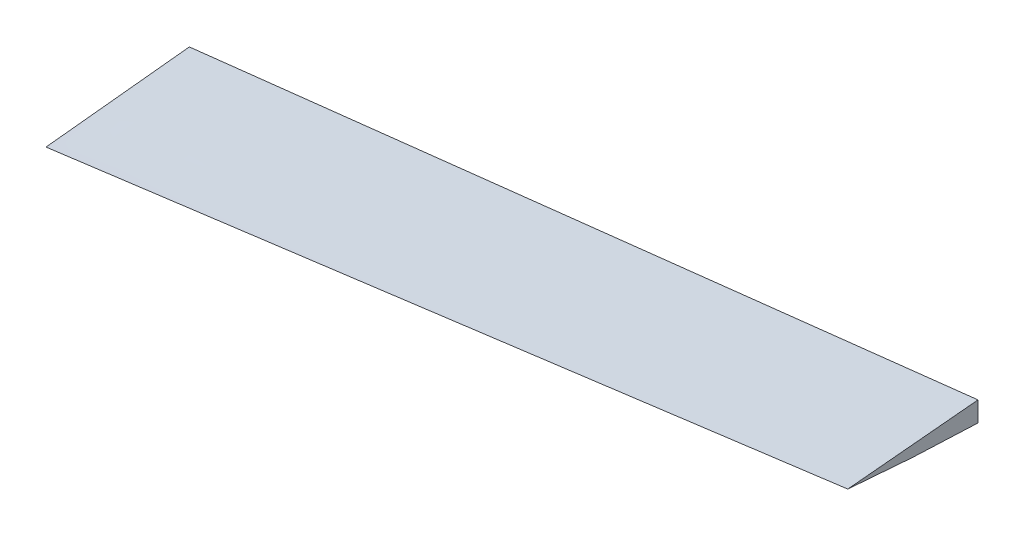
ISO-10303-21;
HEADER;
FILE_DESCRIPTION(('STEP AP214'),'2;1');
FILE_NAME('part.step','',(''),(''),'','','');
FILE_SCHEMA(('AUTOMOTIVE_DESIGN { 1 0 10303 214 1 1 1 1 }'));
ENDSEC;
DATA;
#1=APPLICATION_CONTEXT('core data for automotive mechanical design processes');
#2=APPLICATION_PROTOCOL_DEFINITION('international standard','automotive_design',2000,#1);
#3=PRODUCT_CONTEXT('',#1,'mechanical');
#4=PRODUCT('Part','Part','',(#3));
#5=PRODUCT_RELATED_PRODUCT_CATEGORY('part','',(#4));
#6=PRODUCT_DEFINITION_FORMATION('','',#4);
#7=PRODUCT_DEFINITION_CONTEXT('part definition',#1,'design');
#8=PRODUCT_DEFINITION('design','',#6,#7);
#9=PRODUCT_DEFINITION_SHAPE('','',#8);
#10=(LENGTH_UNIT() NAMED_UNIT(*) SI_UNIT(.MILLI.,.METRE.));
#11=(NAMED_UNIT(*) PLANE_ANGLE_UNIT() SI_UNIT($,.RADIAN.));
#12=(NAMED_UNIT(*) SI_UNIT($,.STERADIAN.) SOLID_ANGLE_UNIT());
#13=UNCERTAINTY_MEASURE_WITH_UNIT(LENGTH_MEASURE(1.E-05),#10,'distance_accuracy_value','');
#14=(GEOMETRIC_REPRESENTATION_CONTEXT(3) GLOBAL_UNCERTAINTY_ASSIGNED_CONTEXT((#13)) GLOBAL_UNIT_ASSIGNED_CONTEXT((#10,
#11,#12)) REPRESENTATION_CONTEXT('',''));
#15=CARTESIAN_POINT('',(0.,0.,0.));
#16=DIRECTION('',(0.,0.,1.));
#17=DIRECTION('',(1.,0.,0.));
#18=AXIS2_PLACEMENT_3D('',#15,#16,#17);
#19=CARTESIAN_POINT('',(940.,-9.56504290397643,223.608063618976));
#20=CARTESIAN_POINT('',(3360.,233.06816214663,316.471394972551));
#21=CARTESIAN_POINT('',(940.,-8.02027267485098,223.497813242443));
#22=CARTESIAN_POINT('',(3360.,233.496407991043,316.470996572016));
#23=CARTESIAN_POINT('',(940.,-4.47959626742021,223.565804357872));
#24=CARTESIAN_POINT('',(3360.,234.458537813297,316.589259715092));
#25=CARTESIAN_POINT('',(940.000000000001,1.44669236690267,225.134502057212));
#26=CARTESIAN_POINT('',(3360.,236.066287107498,317.232072138334));
#27=CARTESIAN_POINT('',(940.,6.82643414570751,228.576352450416));
#28=CARTESIAN_POINT('',(3360.,237.667267163745,318.437261276939));
#29=CARTESIAN_POINT('',(939.999999999999,11.7404895707824,233.544787952069));
#30=CARTESIAN_POINT('',(3360.,239.358283762587,320.270295635811));
#31=CARTESIAN_POINT('',(940.000000000004,15.5733875232566,238.995317221905));
#32=CARTESIAN_POINT('',(3360.,240.893793376099,322.461115807963));
#33=CARTESIAN_POINT('',(939.999999999993,20.0245016339786,247.231373002064));
#34=CARTESIAN_POINT('',(3360.,242.932692406803,326.130376119627));
#35=CARTESIAN_POINT('',(940.,22.5438468459346,253.474702898048));
#36=CARTESIAN_POINT('',(3360.,244.270828890109,329.261763328095));
#37=CARTESIAN_POINT('',(940.,25.9808918699352,262.872038456949));
#38=CARTESIAN_POINT('',(3360.,246.128552322601,334.244386981412));
#39=CARTESIAN_POINT('',(940.,27.8104633982039,268.388131093572));
#40=CARTESIAN_POINT('',(3360.,247.110816021893,337.363556728091));
#41=CARTESIAN_POINT('',(940.,30.7153223458365,278.678756285474));
#42=CARTESIAN_POINT('',(3360.,248.719392241408,343.255978527393));
#43=CARTESIAN_POINT('',(940.000000000003,33.138795242613,288.836415521017));
#44=CARTESIAN_POINT('',(3360.,250.116079008917,349.135834544944));
#45=CARTESIAN_POINT('',(940.000000000001,35.3471243918836,303.677135629769));
#46=CARTESIAN_POINT('',(3360.,251.704084177296,357.988674236495));
#47=CARTESIAN_POINT('',(939.999999999995,36.6183946800392,317.892798928758));
#48=CARTESIAN_POINT('',(3360.,252.885869741036,366.834831102443));
#49=CARTESIAN_POINT('',(940.000000000002,37.3940738106048,331.595074097015));
#50=CARTESIAN_POINT('',(3360.,253.793628857933,375.733342377245));
#51=CARTESIAN_POINT('',(940.000000000003,37.9293533689735,348.066452763089));
#52=CARTESIAN_POINT('',(3360.,254.668331292051,386.911859580299));
#53=CARTESIAN_POINT('',(939.999999999999,38.0502423959914,372.436117347362));
#54=CARTESIAN_POINT('',(3360.,255.645862138178,404.519070337089));
#55=CARTESIAN_POINT('',(940.000000000003,37.3327630580721,402.641516215683));
#56=CARTESIAN_POINT('',(3360.,256.273732028299,428.269697011403));
#57=CARTESIAN_POINT('',(939.999999999999,35.4137070709717,444.681451692998));
#58=CARTESIAN_POINT('',(3360.,256.315756402199,463.872630004857));
#59=CARTESIAN_POINT('',(939.999999999997,31.6478396439324,500.620148874405));
#60=CARTESIAN_POINT('',(3360.,255.056609378194,514.904852075));
#61=CARTESIAN_POINT('',(940.000000000002,25.8786893106136,565.958031444988));
#62=CARTESIAN_POINT('',(3360.,251.773063995229,578.18343803737));
#63=CARTESIAN_POINT('',(940.000000000002,17.3085207564867,650.079015738308));
#64=CARTESIAN_POINT('',(3360.,246.084668733733,659.522033806449));
#65=CARTESIAN_POINT('',(940.000000000008,7.40540733564246,736.461203085278));
#66=CARTESIAN_POINT('',(3360.,239.250861372892,737.909847676662));
#67=CARTESIAN_POINT('',(940.000000000001,-2.68867718335003,819.245433400626));
#68=CARTESIAN_POINT('',(3360.,233.53799144423,796.976654523425));
#69=CARTESIAN_POINT('',(939.999999999999,-8.94635525197262,870.733978391583));
#70=CARTESIAN_POINT('',(3360.,230.930435741034,823.76987020457));
#71=CARTESIAN_POINT('',(940.000000000001,-12.1203359875502,898.425041911615));
#72=CARTESIAN_POINT('',(3360.,229.89104364015,834.858154549589));
#73=CARTESIAN_POINT('',(940.,-13.7508929308094,913.830187168131));
#74=CARTESIAN_POINT('',(3360.,229.421550641686,840.072160833978));
#75=CARTESIAN_POINT('',(940.,-14.5374621759064,922.36388880254));
#76=CARTESIAN_POINT('',(3360.,229.209954317924,842.544297697433));
#77=CARTESIAN_POINT('',(940.,-14.8299720217607,926.500408186417));
#78=CARTESIAN_POINT('',(3360.,229.119465308292,843.640653398131));
#79=B_SPLINE_SURFACE_WITH_KNOTS('',3,1,((#19,#20),(#21,#22),(#23,#24),(#25,#26),(#27,#28),(#29,
#30),(#31,#32),(#33,#34),(#35,#36),(#37,#38),(#39,#40),(#41,#42),(#43,#44),(#45,#46),(#47,#48),
(#49,#50),(#51,#52),(#53,#54),(#55,#56),(#57,#58),(#59,#60),(#61,#62),(#63,#64),(#65,#66),(#67,
#68),(#69,#70),(#71,#72),(#73,#74),(#75,#76),(#77,#78)),.UNSPECIFIED.,.F.,.F.,.F.,(4,1,1,1,1,1,
1,2,1,1,1,1,1,1,1,1,1,1,1,1,1,1,1,1,1,1,4),(2,2),(0.,0.006410597040166,0.0145892274152385,
0.0251414710265059,0.0325314048408687,0.0434282834039079,0.0526341051839309,0.0712473531888315,
0.0940570235538322,0.0952868127871718,0.115512955845202,0.137248293798024,0.157352167069718,
0.174582367361767,0.194057023553832,0.225576732325112,0.275447871083008,0.319119109874962,
0.399782931370474,0.507524346583521,0.590635284325762,0.749813465416931,0.86745200704032,
0.935872620431236,0.964526277833232,0.982833591965527,1.),(0.,1.),.UNSPECIFIED.);
#80=CARTESIAN_POINT('',(3328.92286904907,239.81860458528,696.644589368094));
#81=CARTESIAN_POINT('',(3328.92286904907,239.393877453436,701.583260516498));
#82=CARTESIAN_POINT('',(3328.92286904907,238.963378906763,706.521433356705));
#83=CARTESIAN_POINT('',(3328.92286904907,238.091651953374,716.396790855336));
#84=CARTESIAN_POINT('',(3328.92286904907,237.650423635784,721.333975521624));
#85=CARTESIAN_POINT('',(3328.92286904907,236.75804464591,731.207429241565));
#86=CARTESIAN_POINT('',(3328.92286904907,236.306894009572,736.143698298468));
#87=CARTESIAN_POINT('',(3328.92286904907,235.395538970096,746.015400213559));
#88=CARTESIAN_POINT('',(3328.92286904907,234.935334566629,750.950833071715));
#89=CARTESIAN_POINT('',(3328.92286904907,234.006867957854,760.820953312913));
#90=CARTESIAN_POINT('',(3328.92286904907,233.5386057315,765.755640693974));
#91=CARTESIAN_POINT('',(3328.92286904907,232.831126528605,773.157168743153));
#92=CARTESIAN_POINT('',(3328.92286904907,232.594453253181,775.624252987948));
#93=CARTESIAN_POINT('',(3328.92286904907,232.119617368232,780.558278308538));
#94=CARTESIAN_POINT('',(3328.92286904907,231.881454758623,783.025219384325));
#95=CARTESIAN_POINT('',(3328.92286904907,231.403884619441,787.958988599477));
#96=CARTESIAN_POINT('',(3328.92286904907,231.164477086054,790.425816738474));
#97=CARTESIAN_POINT('',(3328.92286904907,230.684732490292,795.359382004593));
#98=CARTESIAN_POINT('',(3328.92286904907,230.444395428136,797.826119131736));
#99=CARTESIAN_POINT('',(3328.92286904907,229.963207249702,802.759548705881));
#100=CARTESIAN_POINT('',(3328.92286904907,229.72235613229,805.226241152773));
#101=CARTESIAN_POINT('',(3328.92286904907,229.240739175007,810.159636724958));
#102=CARTESIAN_POINT('',(3328.92286904907,228.999973335215,812.626339850261));
#103=CARTESIAN_POINT('',(3328.92286904907,228.639587855509,816.32647111653));
#104=CARTESIAN_POINT('',(3328.92286904907,228.519586470256,817.559862054614));
#105=CARTESIAN_POINT('',(3328.92286904907,228.280007688238,820.026684866878));
#106=CARTESIAN_POINT('',(3328.92286904907,228.160430291384,821.260116741048));
#107=CARTESIAN_POINT('',(3328.92286904907,227.921914163429,823.727038505178));
#108=CARTESIAN_POINT('',(3328.92286904907,227.802975430396,824.960528394952));
#109=CARTESIAN_POINT('',(3328.92286904907,227.566022576306,827.427598087217));
#110=CARTESIAN_POINT('',(3328.92286904907,227.44800845598,828.66117788978));
#111=CARTESIAN_POINT('',(3328.92286904907,227.252445654948,830.71726352122));
#112=CARTESIAN_POINT('',(3328.92286904907,227.174520805653,831.539733554852));
#113=CARTESIAN_POINT('',(3328.92286904907,227.019458290636,833.184747334415));
#114=CARTESIAN_POINT('',(3328.92286904907,226.942320624376,834.007291080295));
#115=CARTESIAN_POINT('',(3328.92286904907,226.789072230322,835.652472564428));
#116=CARTESIAN_POINT('',(3328.92286904907,226.712961500369,836.475110302479));
#117=CARTESIAN_POINT('',(3328.92286904907,226.56211179472,838.120520926468));
#118=CARTESIAN_POINT('',(3328.92286904907,226.487372833934,838.943293813777));
#119=CARTESIAN_POINT('',(3328.92286904907,226.376708911837,840.177583452474));
#120=CARTESIAN_POINT('',(3328.92286904907,226.340061657465,840.589035433972));
#121=CARTESIAN_POINT('',(3328.92286904907,226.267346669692,841.41199041302));
#122=CARTESIAN_POINT('',(3328.92286904907,226.231278935965,841.823493410541));
#123=CARTESIAN_POINT('',(3328.92286904907,226.159879278453,842.64656760727));
#124=CARTESIAN_POINT('',(3328.92286904907,226.124547362087,843.058138807124));
#125=CARTESIAN_POINT('',(3328.92286904907,226.054850097275,843.881363744195));
#126=CARTESIAN_POINT('',(3328.92286904907,226.020484750684,844.293017481571));
#127=CARTESIAN_POINT('',(3328.92286904907,225.986717949072,844.704720939502));
#128=B_SPLINE_CURVE_WITH_KNOTS('',3,(#80,#81,#82,#83,#84,#85,#86,#87,#88,#89,#90,#91,#92,#93,
#94,#95,#96,#97,#98,#99,#100,#101,#102,#103,#104,#105,#106,#107,#108,#109,#110,#111,#112,#113,
#114,#115,#116,#117,#118,#119,#120,#121,#122,#123,#124,#125,#126,#127),.UNSPECIFIED.,.F.,.F.,(4,
2,2,2,2,2,2,2,2,2,2,2,2,2,2,2,2,2,2,2,2,2,2,4),(0.,14.8706962593524,29.7412690383978,
44.6117879548365,59.4823074122399,74.3528657149413,81.7880970358295,89.223328772546,
96.6585832989865,104.093836080485,111.529105290876,118.9643814333,122.682026052742,
126.399669881223,130.117302462882,133.834937988484,136.313397550248,138.791855413644,
141.270308063794,143.748787635639,144.988029734181,146.227271134862,147.466525024786,
148.705781291022),.UNSPECIFIED.);
#129=CARTESIAN_POINT('',(3328.92286904907,239.81860458528,696.644589368094));
#130=VERTEX_POINT('',#129);
#131=CARTESIAN_POINT('',(3328.92286904907,225.986717949072,844.704720939503));
#132=VERTEX_POINT('',#131);
#133=EDGE_CURVE('E70',#130,#132,#128,.T.);
#134=CARTESIAN_POINT('',(2447.30235188464,154.239299038269,711.903406011324));
#135=CARTESIAN_POINT('',(2568.95988776929,166.07600572648,709.797794813321));
#136=CARTESIAN_POINT('',(2690.61845248839,177.902135174165,707.692165808567));
#137=CARTESIAN_POINT('',(2873.10795557257,195.624268707827,704.533693639802));
#138=CARTESIAN_POINT('',(2933.93806584848,201.528803104361,703.480864808104));
#139=CARTESIAN_POINT('',(3106.15228778816,218.236535456942,700.500234043763));
#140=CARTESIAN_POINT('',(3217.53707102553,229.032809228159,698.572420487732));
#141=CARTESIAN_POINT('',(3328.92286904907,239.81860458528,696.644589368094));
#142=B_SPLINE_CURVE_WITH_KNOTS('',3,(#134,#135,#136,#137,#138,#139,#140,#141),.UNSPECIFIED.,.F.,
.F.,(4,2,2,4),(0.,366.750425875828,550.125638292791,885.895816228931),.UNSPECIFIED.);
#143=CARTESIAN_POINT('',(2447.30235188464,154.239299038268,711.903406011324));
#144=VERTEX_POINT('',#143);
#145=EDGE_CURVE('E94',#144,#130,#142,.T.);
#146=CARTESIAN_POINT('',(2447.30235188464,154.239299038269,711.903406011324));
#147=CARTESIAN_POINT('',(2447.30235188464,153.901181779624,715.300913346903));
#148=CARTESIAN_POINT('',(2447.30235188464,153.560697013205,718.698184748369));
#149=CARTESIAN_POINT('',(2447.30235188464,152.875208153736,725.492271074562));
#150=CARTESIAN_POINT('',(2447.30235188464,152.530204061408,728.889085999362));
#151=CARTESIAN_POINT('',(2447.30235188464,151.83589413983,735.682256193434));
#152=CARTESIAN_POINT('',(2447.30235188464,151.486588335484,739.07861146525));
#153=CARTESIAN_POINT('',(2447.30235188464,150.783887441312,745.870898805664));
#154=CARTESIAN_POINT('',(2447.30235188464,150.430492351552,749.266830874268));
#155=CARTESIAN_POINT('',(2447.30235188464,149.719890590803,756.05829659947));
#156=CARTESIAN_POINT('',(2447.30235188464,149.362683919243,759.453830256008));
#157=CARTESIAN_POINT('',(2447.30235188464,148.644763541648,766.244526482214));
#158=CARTESIAN_POINT('',(2447.30235188464,148.284049835828,769.639689051906));
#159=CARTESIAN_POINT('',(2447.30235188464,147.559439890166,776.42968748534));
#160=CARTESIAN_POINT('',(2447.30235188464,147.195543638244,779.824523347794));
#161=CARTESIAN_POINT('',(2447.30235188464,146.464928478762,786.613892000002));
#162=CARTESIAN_POINT('',(2447.30235188464,146.098209570571,790.008424789688));
#163=CARTESIAN_POINT('',(2447.30235188464,145.484995007267,795.665762302538));
#164=CARTESIAN_POINT('',(2447.30235188464,145.239171423317,797.928639918983));
#165=CARTESIAN_POINT('',(2447.30235188464,144.746585058713,802.454292305212));
#166=CARTESIAN_POINT('',(2447.30235188464,144.499822278312,804.717067075023));
#167=CARTESIAN_POINT('',(2447.30235188464,144.005499218229,809.242527221412));
#168=CARTESIAN_POINT('',(2447.30235188464,143.757938939336,811.505212598075));
#169=CARTESIAN_POINT('',(2447.30235188464,143.262210651827,816.030518986471));
#170=CARTESIAN_POINT('',(2447.30235188464,143.014042642618,818.293139998139));
#171=CARTESIAN_POINT('',(2447.30235188464,142.517605468776,822.818373235184));
#172=CARTESIAN_POINT('',(2447.30235188464,142.26933630404,825.08098546055));
#173=CARTESIAN_POINT('',(2447.30235188464,141.773257232358,829.606269170652));
#174=CARTESIAN_POINT('',(2447.30235188464,141.525447327192,831.868940655584));
#175=CARTESIAN_POINT('',(2447.30235188464,141.030956035476,836.394404059674));
#176=CARTESIAN_POINT('',(2447.30235188464,140.784274647464,838.657195978673));
#177=CARTESIAN_POINT('',(2447.30235188464,140.292814912716,843.182979270085));
#178=CARTESIAN_POINT('',(2447.30235188464,140.048036559707,845.445970641815));
#179=CARTESIAN_POINT('',(2447.30235188464,139.683052601572,848.840680292605));
#180=CARTESIAN_POINT('',(2447.30235188464,139.561755854132,849.972281217774));
#181=CARTESIAN_POINT('',(2447.30235188464,139.320272257106,852.235600408934));
#182=CARTESIAN_POINT('',(2447.30235188464,139.200085406301,853.367318674794));
#183=CARTESIAN_POINT('',(2447.30235188464,139.001026715525,855.253683424999));
#184=CARTESIAN_POINT('',(2447.30235188464,138.921736099067,856.008285705963));
#185=CARTESIAN_POINT('',(2447.30235188464,138.763962735591,857.517575577193));
#186=CARTESIAN_POINT('',(2447.30235188464,138.68547998943,858.272263167548));
#187=CARTESIAN_POINT('',(2447.30235188464,138.529448206426,859.781738039569));
#188=CARTESIAN_POINT('',(2447.30235188464,138.451899173394,860.536525321629));
#189=CARTESIAN_POINT('',(2447.30235188464,138.297971037103,862.04622383827));
#190=CARTESIAN_POINT('',(2447.30235188464,138.221591940745,862.801135073556));
#191=CARTESIAN_POINT('',(2447.30235188464,138.07038341548,864.311110545028));
#192=CARTESIAN_POINT('',(2447.30235188464,137.995553981595,865.066174780713));
#193=CARTESIAN_POINT('',(2447.30235188464,137.847824309025,866.57648470934));
#194=CARTESIAN_POINT('',(2447.30235188464,137.774924051188,867.331730400405));
#195=CARTESIAN_POINT('',(2447.30235188464,137.631513003727,868.842509611029));
#196=CARTESIAN_POINT('',(2447.30235188464,137.561002403801,869.598043148647));
#197=CARTESIAN_POINT('',(2447.30235188464,137.424111748015,871.10949336672));
#198=CARTESIAN_POINT('',(2447.30235188464,137.357731710373,871.865410048851));
#199=CARTESIAN_POINT('',(2447.30235188464,137.231052694076,873.377787656102));
#200=CARTESIAN_POINT('',(2447.30235188464,137.170754015199,874.134248606203));
#201=CARTESIAN_POINT('',(2447.30235188464,137.114474518952,874.891026670315));
#202=B_SPLINE_CURVE_WITH_KNOTS('',3,(#146,#147,#148,#149,#150,#151,#152,#153,#154,#155,#156,
#157,#158,#159,#160,#161,#162,#163,#164,#165,#166,#167,#168,#169,#170,#171,#172,#173,#174,#175,
#176,#177,#178,#179,#180,#181,#182,#183,#184,#185,#186,#187,#188,#189,#190,#191,#192,#193,#194,
#195,#196,#197,#198,#199,#200,#201),.UNSPECIFIED.,.F.,.F.,(4,2,2,2,2,2,2,2,2,2,2,2,2,2,2,2,2,2,
2,2,2,2,2,2,2,2,2,4),(0.,10.2428700961824,20.4857385573688,30.7285477466414,40.9713567699184,
51.2141673313228,61.4569772600907,71.6998260802671,81.9426771908076,88.7712492553256,
95.5998194833511,102.428382969072,109.256953127467,116.085530221921,122.914133746585,
129.74272842498,136.571300586764,139.985550119495,143.399795904441,145.676065405756,
147.952337319778,150.228618519277,152.504913140212,154.781200445441,157.057465143699,
159.333910118316,161.610365132609,163.886932308512),.UNSPECIFIED.);
#203=CARTESIAN_POINT('',(2447.30235188464,137.114474518952,874.891026670315));
#204=VERTEX_POINT('',#203);
#205=EDGE_CURVE('E81',#144,#204,#202,.T.);
#206=DIRECTION('',(0.994380668982466,0.100239092847171,-0.0340471646273134));
#207=VECTOR('',#206,1.);
#208=CARTESIAN_POINT('',(2150.,107.144746643266,885.070530792274));
#209=LINE('',#208,#207);
#210=EDGE_CURVE('E97',#204,#132,#209,.T.);
#211=ORIENTED_EDGE('',*,*,#133,.F.);
#212=ORIENTED_EDGE('',*,*,#145,.F.);
#213=ORIENTED_EDGE('',*,*,#205,.T.);
#214=ORIENTED_EDGE('',*,*,#210,.T.);
#215=EDGE_LOOP('',(#211,#212,#213,#214));
#216=FACE_BOUND('',#215,.T.);
#217=ADVANCED_FACE('F40',(#216),#79,.T.);
#218=CARTESIAN_POINT('',(940.,-14.8299720217606,926.500408186417));
#219=CARTESIAN_POINT('',(3360.,229.119465308292,843.640653398132));
#220=CARTESIAN_POINT('',(940.,-15.8932587268398,916.388631923073));
#221=CARTESIAN_POINT('',(3360.,228.322078598752,836.057566010961));
#222=CARTESIAN_POINT('',(940.,-17.0001137799086,904.498563968127));
#223=CARTESIAN_POINT('',(3360.,227.494707966312,827.140593494319));
#224=CARTESIAN_POINT('',(939.999999999999,-18.9613196522661,880.875095925324));
#225=CARTESIAN_POINT('',(3360.,226.02568124722,809.424775119013));
#226=CARTESIAN_POINT('',(939.999999999999,-20.0324396141344,866.085351309633));
#227=CARTESIAN_POINT('',(3360.,225.224464219777,798.333371553742));
#228=CARTESIAN_POINT('',(939.999999999998,-22.3336828550972,830.647110753391));
#229=CARTESIAN_POINT('',(3360.00000000001,223.496678075171,771.757649537834));
#230=CARTESIAN_POINT('',(939.999999999999,-23.7924488767552,802.527278503484));
#231=CARTESIAN_POINT('',(3360.00000000001,222.397089675601,750.670415442586));
#232=CARTESIAN_POINT('',(940.,-25.8173053060718,755.14906946034));
#233=CARTESIAN_POINT('',(3360.00000000001,220.881866304308,715.139796911045));
#234=CARTESIAN_POINT('',(940.,-27.0159327941927,720.562956803205));
#235=CARTESIAN_POINT('',(3360.,219.980734269206,689.202932003744));
#236=CARTESIAN_POINT('',(940.,-28.3436125266727,671.680999888286));
#237=CARTESIAN_POINT('',(3360.,218.984825915022,652.544899226358));
#238=CARTESIAN_POINT('',(939.999999999999,-29.1783691040758,631.538422450321));
#239=CARTESIAN_POINT('',(3360.,218.354733797809,622.441190860024));
#240=CARTESIAN_POINT('',(939.999999999998,-30.3078641830483,557.878796797661));
#241=CARTESIAN_POINT('',(3360.,217.518554674968,567.201771469934));
#242=CARTESIAN_POINT('',(939.999999999997,-30.6464596896065,497.178694517654));
#243=CARTESIAN_POINT('',(3360.,217.257034196145,521.681269530901));
#244=CARTESIAN_POINT('',(940.,-30.4741904655422,436.430894156495));
#245=CARTESIAN_POINT('',(3360.,217.391445183068,476.125102186916));
#246=CARTESIAN_POINT('',(940.000000000002,-30.3432937833002,415.080038305095));
#247=CARTESIAN_POINT('',(3360.,217.489033531404,460.113571927188));
#248=CARTESIAN_POINT('',(940.000000000002,-30.0570749722948,385.108987674022));
#249=CARTESIAN_POINT('',(3360.,217.697418828004,437.63734356756));
#250=CARTESIAN_POINT('',(940.,-29.7974679406378,366.155924276402));
#251=CARTESIAN_POINT('',(3360.,217.892859219719,423.423974124328));
#252=CARTESIAN_POINT('',(940.,-29.3497715866658,343.670027836794));
#253=CARTESIAN_POINT('',(3360.,218.230916399885,406.561437342048));
#254=CARTESIAN_POINT('',(939.999999999999,-29.1474961235818,335.125071492125));
#255=CARTESIAN_POINT('',(3360.,218.38151361521,400.153386173157));
#256=CARTESIAN_POINT('',(939.999999999999,-28.7923298332118,323.598923194741));
#257=CARTESIAN_POINT('',(3359.99999999999,218.642517052059,391.509266490726));
#258=CARTESIAN_POINT('',(939.999999999998,-28.560060498694,316.93339756157));
#259=CARTESIAN_POINT('',(3359.99999999999,218.814080179768,386.510393714428));
#260=CARTESIAN_POINT('',(940.000000000001,-28.2419819838638,309.843529655706));
#261=CARTESIAN_POINT('',(3360.,219.06205935287,381.194234183364));
#262=CARTESIAN_POINT('',(940.000000000001,-28.0523645662856,306.574629339644));
#263=CARTESIAN_POINT('',(3360.,219.197348429622,378.742344655634));
#264=CARTESIAN_POINT('',(940.000000000001,-27.8060341079957,302.544417825675));
#265=CARTESIAN_POINT('',(3360.00000000001,219.37130677866,375.719212463484));
#266=CARTESIAN_POINT('',(939.999999999999,-27.439759476821,297.529578500427));
#267=CARTESIAN_POINT('',(3360.,219.648497755199,371.958819962234));
#268=CARTESIAN_POINT('',(939.999999999999,-26.6522670133843,288.379804389478));
#269=CARTESIAN_POINT('',(3360.,220.258647593337,365.098716893707));
#270=CARTESIAN_POINT('',(940.000000000001,-25.7647492474548,279.550505275756));
#271=CARTESIAN_POINT('',(3360.,220.921673131539,358.477793203704));
#272=CARTESIAN_POINT('',(940.000000000001,-24.9620060739258,272.550133465626));
#273=CARTESIAN_POINT('',(3360.,221.513071677618,353.226076383093));
#274=CARTESIAN_POINT('',(940.000000000001,-24.1130893892486,265.455525260418));
#275=CARTESIAN_POINT('',(3360.,222.159067449965,347.906121258696));
#276=CARTESIAN_POINT('',(940.000000000001,-23.4791848057045,260.771315472134));
#277=CARTESIAN_POINT('',(3360.,222.631467496281,344.392425454581));
#278=CARTESIAN_POINT('',(940.,-22.0755057940592,251.813797322593));
#279=CARTESIAN_POINT('',(3360.,223.692161681318,337.676768904303));
#280=CARTESIAN_POINT('',(939.999999999999,-21.0870729356147,246.381740663081));
#281=CARTESIAN_POINT('',(3360.00000000001,224.437740009327,333.603445098729));
#282=CARTESIAN_POINT('',(939.999999999999,-19.6452394563345,240.423370306185));
#283=CARTESIAN_POINT('',(3360.,225.528410637678,329.13802537888));
#284=CARTESIAN_POINT('',(939.999999999999,-18.9099252504872,237.682529783245));
#285=CARTESIAN_POINT('',(3360.,226.080325817828,327.082052477647));
#286=CARTESIAN_POINT('',(940.,-18.0516611436219,234.900686387334));
#287=CARTESIAN_POINT('',(3360.,226.729240567138,324.997724312384));
#288=CARTESIAN_POINT('',(940.,-17.2788054453614,232.752755557766));
#289=CARTESIAN_POINT('',(3360.00000000001,227.310185316446,323.387272455606));
#290=CARTESIAN_POINT('',(940.,-16.414922368223,230.613861559096));
#291=CARTESIAN_POINT('',(3360.00000000001,227.9635490934,321.787682324484));
#292=CARTESIAN_POINT('',(940.,-15.7504998712154,229.228731936651));
#293=CARTESIAN_POINT('',(3360.,228.461747569289,320.748935254075));
#294=CARTESIAN_POINT('',(939.999999999999,-14.7599674749285,227.495540597207));
#295=CARTESIAN_POINT('',(3360.,229.203792778444,319.449367623387));
#296=CARTESIAN_POINT('',(939.999999999999,-14.1587121972313,226.581023084634));
#297=CARTESIAN_POINT('',(3360.,229.653727342329,318.763402552757));
#298=CARTESIAN_POINT('',(939.999999999999,-13.0377779219564,225.311005523702));
#299=CARTESIAN_POINT('',(3360.,230.490584935732,317.794444067586));
#300=CARTESIAN_POINT('',(940.,-12.2429079692271,224.589787557199));
#301=CARTESIAN_POINT('',(3360.,231.082317493923,317.246922343787));
#302=CARTESIAN_POINT('',(940.,-10.955968894628,223.867436203481));
#303=CARTESIAN_POINT('',(3360.,232.024274968376,316.693334255142));
#304=CARTESIAN_POINT('',(940.,-10.1288468833064,223.639039661241));
#305=CARTESIAN_POINT('',(3360.,232.645113386948,316.507628005983));
#306=CARTESIAN_POINT('',(940.,-9.5650429039759,223.608063618976));
#307=CARTESIAN_POINT('',(3360.,233.068162146631,316.471394972551));
#308=B_SPLINE_SURFACE_WITH_KNOTS('',3,1,((#218,#219),(#220,#221),(#222,#223),(#224,#225),(#226,
#227),(#228,#229),(#230,#231),(#232,#233),(#234,#235),(#236,#237),(#238,#239),(#240,#241),(#242,
#243),(#244,#245),(#246,#247),(#248,#249),(#250,#251),(#252,#253),(#254,#255),(#256,#257),(#258,
#259),(#260,#261),(#262,#263),(#264,#265),(#266,#267),(#268,#269),(#270,#271),(#272,#273),(#274,
#275),(#276,#277),(#278,#279),(#280,#281),(#282,#283),(#284,#285),(#286,#287),(#288,#289),(#290,
#291),(#292,#293),(#294,#295),(#296,#297),(#298,#299),(#300,#301),(#302,#303),(#304,#305),(#306,
#307)),.UNSPECIFIED.,.F.,.F.,.F.,(4,1,1,1,1,1,1,1,1,1,1,1,1,1,1,1,1,1,1,1,1,2,1,1,1,2,1,1,1,1,1,
1,1,1,1,1,1,1,1,1,4),(2,2),(0.,0.0430984414381896,0.0506157510893491,0.100479794288408,
0.10595230945046,0.201149410798296,0.219829325961069,0.306963456382857,0.347840016938749,
0.427108630931488,0.477156658269096,0.660107141138051,0.684403332457358,0.734657294440846,
0.750611442383879,0.811451545949787,0.815003124434654,0.845944212293286,0.84768208293399,
0.863884050145848,0.874215202686331,0.877764033582396,0.891330957802499,0.899076556737716,
0.916691643033932,0.928943609425639,0.946979805856867,0.948980378273081,0.967367658550568,
0.970369336034846,0.974966043779617,0.979396155609305,0.982707817287566,0.98464033450793,
0.989162794169177,0.989210425788685,0.993094201561276,0.993781508728646,0.99639653415333,
0.997610586858735,1.),(0.,1.),.UNSPECIFIED.);
#309=CARTESIAN_POINT('',(3328.92286904907,225.986717949072,844.704720939503));
#310=CARTESIAN_POINT('',(3328.92286904907,225.771147672494,842.654643745121));
#311=CARTESIAN_POINT('',(3328.92286904907,225.562331269841,840.603864183564));
#312=CARTESIAN_POINT('',(3328.92286904907,225.157060028824,836.501100438207));
#313=CARTESIAN_POINT('',(3328.92286904907,224.960605085295,834.449116264804));
#314=CARTESIAN_POINT('',(3328.92286904907,224.578958408317,830.344661932243));
#315=CARTESIAN_POINT('',(3328.92286904907,224.393763652248,828.292192053302));
#316=CARTESIAN_POINT('',(3328.92286904907,224.033391097939,824.186369494626));
#317=CARTESIAN_POINT('',(3328.92286904907,223.858213325242,822.133016812654));
#318=CARTESIAN_POINT('',(3328.92286904907,223.516880121472,818.025875745863));
#319=CARTESIAN_POINT('',(3328.92286904907,223.350723329069,815.972087474));
#320=CARTESIAN_POINT('',(3328.92286904907,223.02684994375,811.863848289889));
#321=CARTESIAN_POINT('',(3328.92286904907,222.869133342568,809.809397378292));
#322=CARTESIAN_POINT('',(3328.92286904907,222.56152854539,805.700072484504));
#323=CARTESIAN_POINT('',(3328.92286904907,222.411639736169,803.645198548154));
#324=CARTESIAN_POINT('',(3328.92286904907,222.119079728606,799.53493686669));
#325=CARTESIAN_POINT('',(3328.92286904907,221.976408533045,797.479549121379));
#326=CARTESIAN_POINT('',(3328.92286904907,221.697653994294,793.36840041459));
#327=CARTESIAN_POINT('',(3328.92286904907,221.561570418981,791.312639468828));
#328=CARTESIAN_POINT('',(3328.92286904907,221.295485154336,787.200724682973));
#329=CARTESIAN_POINT('',(3328.92286904907,221.165483464097,785.144570842938));
#330=CARTESIAN_POINT('',(3328.92286904907,220.911343495049,781.031914991165));
#331=CARTESIAN_POINT('',(3328.92286904907,220.787205176285,778.975412981893));
#332=CARTESIAN_POINT('',(3328.92286904907,220.544525095476,774.862079462797));
#333=CARTESIAN_POINT('',(3328.92286904907,220.425983333404,772.805247952973));
#334=CARTESIAN_POINT('',(3328.92286904907,220.078396010605,766.634730426131));
#335=CARTESIAN_POINT('',(3328.92286904907,219.857361928443,762.520591062093));
#336=CARTESIAN_POINT('',(3328.92286904907,219.434594771656,754.291103187129));
#337=CARTESIAN_POINT('',(3328.92286904907,219.232862743303,750.175754622771));
#338=CARTESIAN_POINT('',(3328.92286904907,218.846644526417,741.943933151999));
#339=CARTESIAN_POINT('',(3328.92286904907,218.662159662444,737.827460183541));
#340=CARTESIAN_POINT('',(3328.92286904907,218.396832746434,731.652072865095));
#341=CARTESIAN_POINT('',(3328.92286904907,218.310286728662,729.593401284306));
#342=CARTESIAN_POINT('',(3328.92286904907,218.140749417798,725.475911675893));
#343=CARTESIAN_POINT('',(3328.92286904907,218.05775812463,723.417093648272));
#344=CARTESIAN_POINT('',(3328.92286904907,217.813957353708,717.240004267489));
#345=CARTESIAN_POINT('',(3328.92286904907,217.658339393189,713.121527368556));
#346=CARTESIAN_POINT('',(3328.92286904907,217.360141630324,704.883629802945));
#347=CARTESIAN_POINT('',(3328.92286904907,217.217563320287,700.764209082199));
#348=CARTESIAN_POINT('',(3328.92286904907,217.081120025418,696.644589368094));
#349=B_SPLINE_CURVE_WITH_KNOTS('',3,(#309,#310,#311,#312,#313,#314,#315,#316,#317,#318,#319,
#320,#321,#322,#323,#324,#325,#326,#327,#328,#329,#330,#331,#332,#333,#334,#335,#336,#337,#338,
#339,#340,#341,#342,#343,#344,#345,#346,#347,#348),.UNSPECIFIED.,.F.,.F.,(4,2,2,2,2,2,2,2,2,2,2,
2,2,2,2,2,2,2,2,4),(0.,6.1841172023084,12.3681817869741,18.5505789617129,24.7329919008935,
30.9144692621991,37.0959405687276,43.2769268929072,49.4579155979475,55.6386863507895,
61.8194561828227,68.0001838915739,74.1809115714364,86.5410734559941,98.9019049467916,
111.263684955909,117.445152383854,123.626619680455,135.990844705358,148.356482975216),.UNSPECIFIED.);
#350=CARTESIAN_POINT('',(3328.92286904907,217.081120025418,696.644589368094));
#351=VERTEX_POINT('',#350);
#352=EDGE_CURVE('E11',#132,#351,#349,.T.);
#353=CARTESIAN_POINT('',(2447.30235188464,137.114474518952,874.891026670315));
#354=CARTESIAN_POINT('',(2447.30235188464,136.639872891949,870.377378796616));
#355=CARTESIAN_POINT('',(2447.30235188464,136.19415341231,865.860797787376));
#356=CARTESIAN_POINT('',(2447.30235188464,135.351355932978,856.824292419796));
#357=CARTESIAN_POINT('',(2447.30235188464,134.954265052625,852.304369267224));
#358=CARTESIAN_POINT('',(2447.30235188464,134.388113551594,845.522399653365));
#359=CARTESIAN_POINT('',(2447.30235188464,134.204322814793,843.26156012022));
#360=CARTESIAN_POINT('',(2447.30235188464,133.845888350278,838.739155071906));
#361=CARTESIAN_POINT('',(2447.30235188464,133.671244614875,836.477589557347));
#362=CARTESIAN_POINT('',(2447.30235188464,133.33051342653,831.953992948197));
#363=CARTESIAN_POINT('',(2447.30235188464,133.164425308397,829.691961903571));
#364=CARTESIAN_POINT('',(2447.30235188464,132.840175326328,825.167331629552));
#365=CARTESIAN_POINT('',(2447.30235188464,132.682013464545,822.904732400004));
#366=CARTESIAN_POINT('',(2447.30235188464,132.373003457026,818.379113734275));
#367=CARTESIAN_POINT('',(2447.30235188464,132.222155059211,816.116094315279));
#368=CARTESIAN_POINT('',(2447.30235188464,131.927168725874,811.589618779598));
#369=CARTESIAN_POINT('',(2447.30235188464,131.783030789897,809.326162662943));
#370=CARTESIAN_POINT('',(2447.30235188464,131.501165052961,804.798866222598));
#371=CARTESIAN_POINT('',(2447.30235188464,131.363437210369,802.5350259015));
#372=CARTESIAN_POINT('',(2447.30235188464,131.094108814533,798.006981615386));
#373=CARTESIAN_POINT('',(2447.30235188464,130.96250826105,795.742777650384));
#374=CARTESIAN_POINT('',(2447.30235188464,130.576494237199,788.950135589921));
#375=CARTESIAN_POINT('',(2447.30235188464,130.330839277449,784.421197592704));
#376=CARTESIAN_POINT('',(2447.30235188464,129.860592542894,775.361990784688));
#377=CARTESIAN_POINT('',(2447.30235188464,129.636001898575,770.831721915537));
#378=CARTESIAN_POINT('',(2447.30235188464,129.205587132529,761.76995109744));
#379=CARTESIAN_POINT('',(2447.30235188464,128.999764435091,757.238449081042));
#380=CARTESIAN_POINT('',(2447.30235188464,128.60462932428,748.174310782504));
#381=CARTESIAN_POINT('',(2447.30235188464,128.415318428576,743.641674434421));
#382=CARTESIAN_POINT('',(2447.30235188464,128.051873882362,734.575324607503));
#383=CARTESIAN_POINT('',(2447.30235188464,127.87774180532,730.041611065734));
#384=CARTESIAN_POINT('',(2447.30235188464,127.543818128726,720.973142152714));
#385=CARTESIAN_POINT('',(2447.30235188464,127.384028152814,716.438386721626));
#386=CARTESIAN_POINT('',(2447.30235188464,127.230999408886,711.903406011324));
#387=B_SPLINE_CURVE_WITH_KNOTS('',3,(#353,#354,#355,#356,#357,#358,#359,#360,#361,#362,#363,
#364,#365,#366,#367,#368,#369,#370,#371,#372,#373,#374,#375,#376,#377,#378,#379,#380,#381,#382,
#383,#384,#385,#386),.UNSPECIFIED.,.F.,.F.,(4,2,2,2,2,2,2,2,2,2,2,2,2,2,2,2,4),(0.,
13.6153577778901,27.2271013061145,34.0319834304496,40.8368598351166,47.6412063649103,
54.4455547418496,61.2496684215841,68.0537816398139,74.8578506586981,81.6619194116441,
95.2686450199802,108.876100460938,122.484587706083,136.094324449355,149.705470332978,
163.318155168481),.UNSPECIFIED.);
#388=CARTESIAN_POINT('',(2447.30235188464,127.230999408886,711.903406011324));
#389=VERTEX_POINT('',#388);
#390=EDGE_CURVE('E84',#204,#389,#387,.T.);
#391=CARTESIAN_POINT('',(3328.92286904907,217.081120025418,696.644589368094));
#392=CARTESIAN_POINT('',(3269.70707538257,211.046097482326,697.66947810463));
#393=CARTESIAN_POINT('',(3210.49128034687,205.011088377938,698.694366864863));
#394=CARTESIAN_POINT('',(3092.05968770757,192.941095373124,700.744144429774));
#395=CARTESIAN_POINT('',(3032.84389010396,186.906111472698,701.769033234451));
#396=CARTESIAN_POINT('',(2885.9071396812,171.931067441049,704.312169299461));
#397=CARTESIAN_POINT('',(2798.18618543021,162.991021363182,705.830416584574));
#398=CARTESIAN_POINT('',(2622.7442721352,145.110976251394,708.866911237757));
#399=CARTESIAN_POINT('',(2535.02331309117,136.170977217472,710.385158605827));
#400=CARTESIAN_POINT('',(2447.30235188464,127.230999408886,711.903406011324));
#401=B_SPLINE_CURVE_WITH_KNOTS('',3,(#391,#392,#393,#394,#395,#396,#397,#398,#399,#400),
.UNSPECIFIED.,.F.,.F.,(4,2,2,2,4),(0.,178.594062113325,357.18812422665,621.753348359679,
886.318572492788),.UNSPECIFIED.);
#402=EDGE_CURVE('E56',#351,#389,#401,.T.);
#403=ORIENTED_EDGE('',*,*,#352,.F.);
#404=ORIENTED_EDGE('',*,*,#210,.F.);
#405=ORIENTED_EDGE('',*,*,#390,.T.);
#406=ORIENTED_EDGE('',*,*,#402,.F.);
#407=EDGE_LOOP('',(#403,#404,#405,#406));
#408=FACE_BOUND('',#407,.T.);
#409=ADVANCED_FACE('F42',(#408),#308,.T.);
#410=CARTESIAN_POINT('',(13.0506003402666,-209.311409679221,754.034686326515));
#411=DIRECTION('',(0.0173051005765728,0.,0.999850255535315));
#412=DIRECTION('',(0.999850255535315,0.,-0.0173051005765728));
#413=AXIS2_PLACEMENT_3D('',#410,#411,#412);
#414=PLANE('',#413);
#415=DIRECTION('',(0.,1.,0.));
#416=VECTOR('',#415,1.);
#417=CARTESIAN_POINT('',(2447.30235188464,-209.311409679221,711.903406011324));
#418=LINE('',#417,#416);
#419=EDGE_CURVE('E63',#389,#144,#418,.T.);
#420=ORIENTED_EDGE('',*,*,#419,.T.);
#421=ORIENTED_EDGE('',*,*,#145,.T.);
#422=DIRECTION('',(0.,1.,0.));
#423=VECTOR('',#422,1.);
#424=CARTESIAN_POINT('',(3328.92286904907,-209.311409679221,696.644589368094));
#425=LINE('',#424,#423);
#426=EDGE_CURVE('E89',#351,#130,#425,.T.);
#427=ORIENTED_EDGE('',*,*,#426,.F.);
#428=ORIENTED_EDGE('',*,*,#402,.T.);
#429=EDGE_LOOP('',(#420,#421,#427,#428));
#430=FACE_BOUND('',#429,.T.);
#431=ADVANCED_FACE('F92',(#430),#414,.F.);
#432=CARTESIAN_POINT('',(3328.92286904907,-209.311409679221,0.));
#433=DIRECTION('',(-1.,0.,0.));
#434=DIRECTION('',(0.,0.,1.));
#435=AXIS2_PLACEMENT_3D('',#432,#433,#434);
#436=PLANE('',#435);
#437=ORIENTED_EDGE('',*,*,#426,.T.);
#438=ORIENTED_EDGE('',*,*,#133,.T.);
#439=ORIENTED_EDGE('',*,*,#352,.T.);
#440=EDGE_LOOP('',(#437,#438,#439));
#441=FACE_BOUND('',#440,.T.);
#442=ADVANCED_FACE('F118',(#441),#436,.F.);
#443=CARTESIAN_POINT('',(2447.30235188464,-209.311409679221,0.));
#444=DIRECTION('',(-1.,0.,0.));
#445=DIRECTION('',(0.,0.,1.));
#446=AXIS2_PLACEMENT_3D('',#443,#444,#445);
#447=PLANE('',#446);
#448=ORIENTED_EDGE('',*,*,#205,.F.);
#449=ORIENTED_EDGE('',*,*,#419,.F.);
#450=ORIENTED_EDGE('',*,*,#390,.F.);
#451=EDGE_LOOP('',(#448,#449,#450));
#452=FACE_BOUND('',#451,.T.);
#453=ADVANCED_FACE('F82',(#452),#447,.T.);
#454=CLOSED_SHELL('',(#217,#409,#431,#442,#453));
#455=MANIFOLD_SOLID_BREP('B2',#454);
#456=ADVANCED_BREP_SHAPE_REPRESENTATION('',(#18,#455),#14);
#457=SHAPE_DEFINITION_REPRESENTATION(#9,#456);
ENDSEC;
END-ISO-10303-21;
